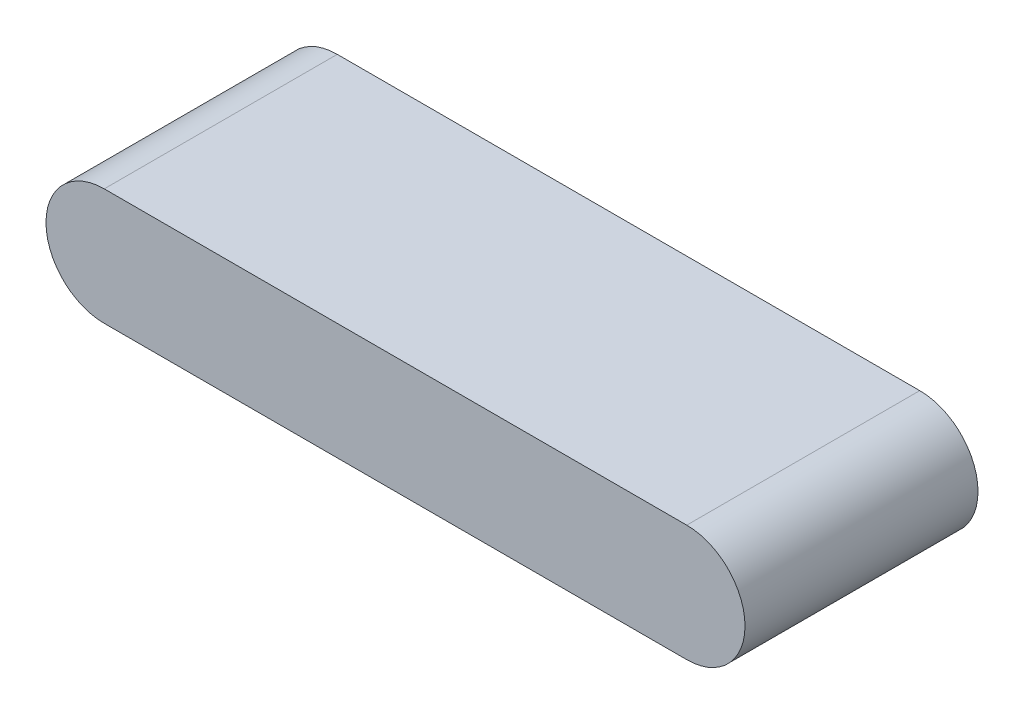
ISO-10303-21;
HEADER;
FILE_DESCRIPTION(('STEP AP214'),'2;1');
FILE_NAME('part.step','',(''),(''),'','','');
FILE_SCHEMA(('AUTOMOTIVE_DESIGN { 1 0 10303 214 1 1 1 1 }'));
ENDSEC;
DATA;
#1=APPLICATION_CONTEXT('core data for automotive mechanical design processes');
#2=APPLICATION_PROTOCOL_DEFINITION('international standard','automotive_design',2000,#1);
#3=PRODUCT_CONTEXT('',#1,'mechanical');
#4=PRODUCT('Part','Part','',(#3));
#5=PRODUCT_RELATED_PRODUCT_CATEGORY('part','',(#4));
#6=PRODUCT_DEFINITION_FORMATION('','',#4);
#7=PRODUCT_DEFINITION_CONTEXT('part definition',#1,'design');
#8=PRODUCT_DEFINITION('design','',#6,#7);
#9=PRODUCT_DEFINITION_SHAPE('','',#8);
#10=(LENGTH_UNIT() NAMED_UNIT(*) SI_UNIT(.MILLI.,.METRE.));
#11=(NAMED_UNIT(*) PLANE_ANGLE_UNIT() SI_UNIT($,.RADIAN.));
#12=(NAMED_UNIT(*) SI_UNIT($,.STERADIAN.) SOLID_ANGLE_UNIT());
#13=UNCERTAINTY_MEASURE_WITH_UNIT(LENGTH_MEASURE(1.E-05),#10,'distance_accuracy_value','');
#14=(GEOMETRIC_REPRESENTATION_CONTEXT(3) GLOBAL_UNCERTAINTY_ASSIGNED_CONTEXT((#13)) GLOBAL_UNIT_ASSIGNED_CONTEXT((#10,
#11,#12)) REPRESENTATION_CONTEXT('',''));
#15=CARTESIAN_POINT('',(0.,0.,0.));
#16=DIRECTION('',(0.,0.,1.));
#17=DIRECTION('',(1.,0.,0.));
#18=AXIS2_PLACEMENT_3D('',#15,#16,#17);
#19=CARTESIAN_POINT('',(-53.7983081875382,0.,25.4));
#20=DIRECTION('',(0.,0.,-1.));
#21=DIRECTION('',(-1.,0.,0.));
#22=AXIS2_PLACEMENT_3D('',#19,#20,#21);
#23=CYLINDRICAL_SURFACE('',#22,12.7);
#24=CARTESIAN_POINT('',(-53.7983081875382,0.,-25.4));
#25=DIRECTION('',(0.,0.,1.));
#26=DIRECTION('',(1.,0.,0.));
#27=AXIS2_PLACEMENT_3D('',#24,#25,#26);
#28=CIRCLE('',#27,12.7);
#29=CARTESIAN_POINT('',(-53.7983081875382,12.7,-25.4));
#30=VERTEX_POINT('',#29);
#31=CARTESIAN_POINT('',(-53.7983081875382,-12.7,-25.4));
#32=VERTEX_POINT('',#31);
#33=EDGE_CURVE('E99',#30,#32,#28,.T.);
#34=ORIENTED_EDGE('',*,*,#33,.T.);
#35=DIRECTION('',(0.,0.,-1.));
#36=VECTOR('',#35,1.);
#37=CARTESIAN_POINT('',(-53.7983081875382,-12.7,25.4));
#38=LINE('',#37,#36);
#39=CARTESIAN_POINT('',(-53.7983081875382,-12.7,25.4));
#40=VERTEX_POINT('',#39);
#41=EDGE_CURVE('E11',#40,#32,#38,.T.);
#42=ORIENTED_EDGE('',*,*,#41,.F.);
#43=CARTESIAN_POINT('',(-53.7983081875382,0.,25.4));
#44=DIRECTION('',(0.,0.,1.));
#45=DIRECTION('',(1.,0.,0.));
#46=AXIS2_PLACEMENT_3D('',#43,#44,#45);
#47=CIRCLE('',#46,12.7);
#48=CARTESIAN_POINT('',(-53.7983081875382,12.7,25.4));
#49=VERTEX_POINT('',#48);
#50=EDGE_CURVE('E87',#49,#40,#47,.T.);
#51=ORIENTED_EDGE('',*,*,#50,.F.);
#52=DIRECTION('',(0.,0.,-1.));
#53=VECTOR('',#52,1.);
#54=CARTESIAN_POINT('',(-53.7983081875382,12.7,25.4));
#55=LINE('',#54,#53);
#56=EDGE_CURVE('E95',#49,#30,#55,.T.);
#57=ORIENTED_EDGE('',*,*,#56,.T.);
#58=EDGE_LOOP('',(#34,#42,#51,#57));
#59=FACE_BOUND('',#58,.T.);
#60=ADVANCED_FACE('F36',(#59),#23,.T.);
#61=CARTESIAN_POINT('',(-53.7983081875382,-12.7,25.4));
#62=DIRECTION('',(0.,1.,0.));
#63=DIRECTION('',(0.,0.,1.));
#64=AXIS2_PLACEMENT_3D('',#61,#62,#63);
#65=PLANE('',#64);
#66=DIRECTION('',(1.,0.,0.));
#67=VECTOR('',#66,1.);
#68=CARTESIAN_POINT('',(-53.7983081875382,-12.7,-25.4));
#69=LINE('',#68,#67);
#70=CARTESIAN_POINT('',(73.2016918124618,-12.7,-25.4));
#71=VERTEX_POINT('',#70);
#72=EDGE_CURVE('E91',#32,#71,#69,.T.);
#73=ORIENTED_EDGE('',*,*,#72,.T.);
#74=DIRECTION('',(0.,0.,-1.));
#75=VECTOR('',#74,1.);
#76=CARTESIAN_POINT('',(73.2016918124618,-12.7,25.4));
#77=LINE('',#76,#75);
#78=CARTESIAN_POINT('',(73.2016918124618,-12.7,25.4));
#79=VERTEX_POINT('',#78);
#80=EDGE_CURVE('E44',#79,#71,#77,.T.);
#81=ORIENTED_EDGE('',*,*,#80,.F.);
#82=DIRECTION('',(1.,0.,0.));
#83=VECTOR('',#82,1.);
#84=CARTESIAN_POINT('',(-53.7983081875382,-12.7,25.4));
#85=LINE('',#84,#83);
#86=EDGE_CURVE('E82',#40,#79,#85,.T.);
#87=ORIENTED_EDGE('',*,*,#86,.F.);
#88=ORIENTED_EDGE('',*,*,#41,.T.);
#89=EDGE_LOOP('',(#73,#81,#87,#88));
#90=FACE_BOUND('',#89,.T.);
#91=ADVANCED_FACE('F90',(#90),#65,.F.);
#92=CARTESIAN_POINT('',(73.2016918124618,0.,25.4));
#93=DIRECTION('',(0.,0.,-1.));
#94=DIRECTION('',(-1.,0.,0.));
#95=AXIS2_PLACEMENT_3D('',#92,#93,#94);
#96=CYLINDRICAL_SURFACE('',#95,12.7);
#97=CARTESIAN_POINT('',(73.2016918124618,0.,-25.4));
#98=DIRECTION('',(0.,0.,1.));
#99=DIRECTION('',(1.,0.,0.));
#100=AXIS2_PLACEMENT_3D('',#97,#98,#99);
#101=CIRCLE('',#100,12.7);
#102=CARTESIAN_POINT('',(73.2016918124618,12.7,-25.4));
#103=VERTEX_POINT('',#102);
#104=EDGE_CURVE('E69',#71,#103,#101,.T.);
#105=ORIENTED_EDGE('',*,*,#104,.T.);
#106=DIRECTION('',(0.,0.,-1.));
#107=VECTOR('',#106,1.);
#108=CARTESIAN_POINT('',(73.2016918124618,12.7,25.4));
#109=LINE('',#108,#107);
#110=CARTESIAN_POINT('',(73.2016918124618,12.7,25.4));
#111=VERTEX_POINT('',#110);
#112=EDGE_CURVE('E92',#111,#103,#109,.T.);
#113=ORIENTED_EDGE('',*,*,#112,.F.);
#114=CARTESIAN_POINT('',(73.2016918124618,0.,25.4));
#115=DIRECTION('',(0.,0.,1.));
#116=DIRECTION('',(1.,0.,0.));
#117=AXIS2_PLACEMENT_3D('',#114,#115,#116);
#118=CIRCLE('',#117,12.7);
#119=EDGE_CURVE('E85',#79,#111,#118,.T.);
#120=ORIENTED_EDGE('',*,*,#119,.F.);
#121=ORIENTED_EDGE('',*,*,#80,.T.);
#122=EDGE_LOOP('',(#105,#113,#120,#121));
#123=FACE_BOUND('',#122,.T.);
#124=ADVANCED_FACE('F93',(#123),#96,.T.);
#125=CARTESIAN_POINT('',(-53.7983081875382,12.7,25.4));
#126=DIRECTION('',(0.,-1.,0.));
#127=DIRECTION('',(0.,0.,-1.));
#128=AXIS2_PLACEMENT_3D('',#125,#126,#127);
#129=PLANE('',#128);
#130=DIRECTION('',(-1.,0.,0.));
#131=VECTOR('',#130,1.);
#132=CARTESIAN_POINT('',(-53.7983081875382,12.7,-25.4));
#133=LINE('',#132,#131);
#134=EDGE_CURVE('E75',#103,#30,#133,.T.);
#135=ORIENTED_EDGE('',*,*,#134,.T.);
#136=ORIENTED_EDGE('',*,*,#56,.F.);
#137=DIRECTION('',(-1.,0.,0.));
#138=VECTOR('',#137,1.);
#139=CARTESIAN_POINT('',(-53.7983081875382,12.7,25.4));
#140=LINE('',#139,#138);
#141=EDGE_CURVE('E52',#111,#49,#140,.T.);
#142=ORIENTED_EDGE('',*,*,#141,.F.);
#143=ORIENTED_EDGE('',*,*,#112,.T.);
#144=EDGE_LOOP('',(#135,#136,#142,#143));
#145=FACE_BOUND('',#144,.T.);
#146=ADVANCED_FACE('F106',(#145),#129,.F.);
#147=CARTESIAN_POINT('',(-53.7983081875382,0.,25.4));
#148=DIRECTION('',(0.,0.,1.));
#149=DIRECTION('',(1.,0.,0.));
#150=AXIS2_PLACEMENT_3D('',#147,#148,#149);
#151=PLANE('',#150);
#152=ORIENTED_EDGE('',*,*,#50,.T.);
#153=ORIENTED_EDGE('',*,*,#86,.T.);
#154=ORIENTED_EDGE('',*,*,#119,.T.);
#155=ORIENTED_EDGE('',*,*,#141,.T.);
#156=EDGE_LOOP('',(#152,#153,#154,#155));
#157=FACE_BOUND('',#156,.T.);
#158=ADVANCED_FACE('F83',(#157),#151,.T.);
#159=CARTESIAN_POINT('',(-53.7983081875382,0.,-25.4));
#160=DIRECTION('',(0.,0.,1.));
#161=DIRECTION('',(1.,0.,0.));
#162=AXIS2_PLACEMENT_3D('',#159,#160,#161);
#163=PLANE('',#162);
#164=ORIENTED_EDGE('',*,*,#33,.F.);
#165=ORIENTED_EDGE('',*,*,#134,.F.);
#166=ORIENTED_EDGE('',*,*,#104,.F.);
#167=ORIENTED_EDGE('',*,*,#72,.F.);
#168=EDGE_LOOP('',(#164,#165,#166,#167));
#169=FACE_BOUND('',#168,.T.);
#170=ADVANCED_FACE('F109',(#169),#163,.F.);
#171=CLOSED_SHELL('',(#60,#91,#124,#146,#158,#170));
#172=MANIFOLD_SOLID_BREP('B2',#171);
#173=ADVANCED_BREP_SHAPE_REPRESENTATION('',(#18,#172),#14);
#174=SHAPE_DEFINITION_REPRESENTATION(#9,#173);
ENDSEC;
END-ISO-10303-21;
